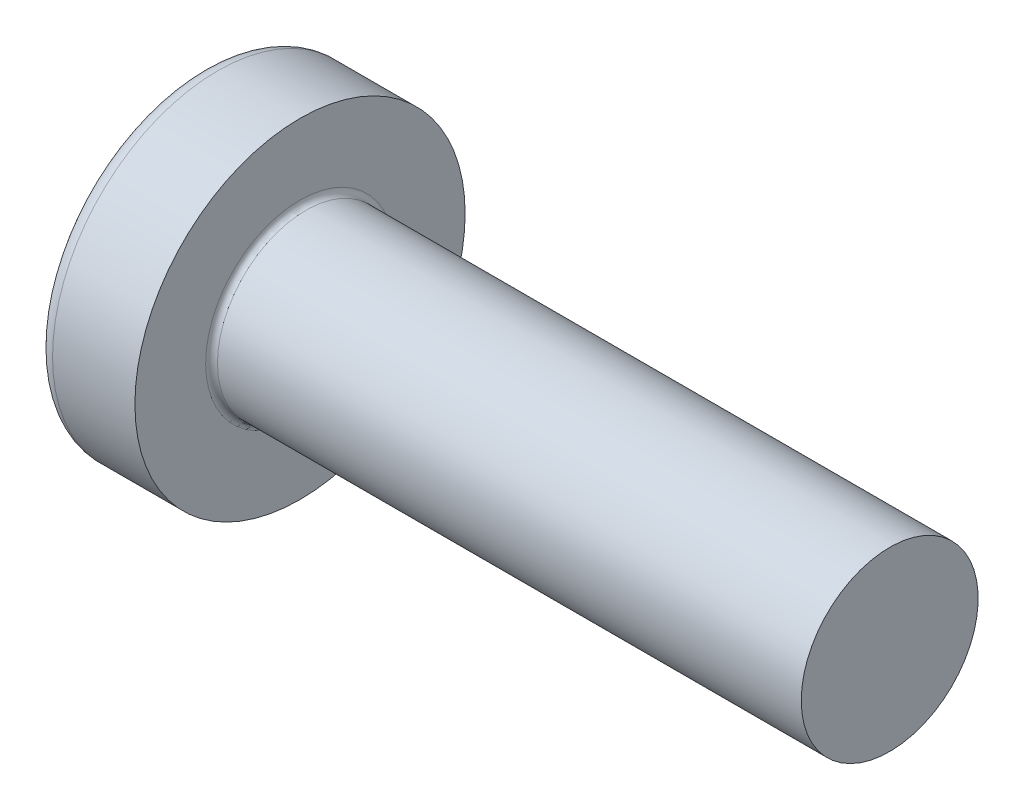
ISO-10303-21;
HEADER;
FILE_DESCRIPTION(('STEP AP214'),'2;1');
FILE_NAME('part.step','',(''),(''),'','','');
FILE_SCHEMA(('AUTOMOTIVE_DESIGN { 1 0 10303 214 1 1 1 1 }'));
ENDSEC;
DATA;
#1=APPLICATION_CONTEXT('core data for automotive mechanical design processes');
#2=APPLICATION_PROTOCOL_DEFINITION('international standard','automotive_design',2000,#1);
#3=PRODUCT_CONTEXT('',#1,'mechanical');
#4=PRODUCT('Part','Part','',(#3));
#5=PRODUCT_RELATED_PRODUCT_CATEGORY('part','',(#4));
#6=PRODUCT_DEFINITION_FORMATION('','',#4);
#7=PRODUCT_DEFINITION_CONTEXT('part definition',#1,'design');
#8=PRODUCT_DEFINITION('design','',#6,#7);
#9=PRODUCT_DEFINITION_SHAPE('','',#8);
#10=(LENGTH_UNIT() NAMED_UNIT(*) SI_UNIT(.MILLI.,.METRE.));
#11=(NAMED_UNIT(*) PLANE_ANGLE_UNIT() SI_UNIT($,.RADIAN.));
#12=(NAMED_UNIT(*) SI_UNIT($,.STERADIAN.) SOLID_ANGLE_UNIT());
#13=UNCERTAINTY_MEASURE_WITH_UNIT(LENGTH_MEASURE(1.E-05),#10,'distance_accuracy_value','');
#14=(GEOMETRIC_REPRESENTATION_CONTEXT(3) GLOBAL_UNCERTAINTY_ASSIGNED_CONTEXT((#13)) GLOBAL_UNIT_ASSIGNED_CONTEXT((#10,
#11,#12)) REPRESENTATION_CONTEXT('',''));
#15=CARTESIAN_POINT('',(0.,0.,0.));
#16=DIRECTION('',(0.,0.,1.));
#17=DIRECTION('',(1.,0.,0.));
#18=AXIS2_PLACEMENT_3D('',#15,#16,#17);
#19=CARTESIAN_POINT('',(5.,0.,0.));
#20=DIRECTION('',(-1.,0.,0.));
#21=DIRECTION('',(0.,1.,0.));
#22=AXIS2_PLACEMENT_3D('',#19,#20,#21);
#23=SPHERICAL_SURFACE('',#22,5.);
#24=CARTESIAN_POINT('',(0.775371598933733,0.,0.));
#25=DIRECTION('',(-1.,0.,0.));
#26=DIRECTION('',(0.,0.,1.));
#27=AXIS2_PLACEMENT_3D('',#24,#25,#26);
#28=CIRCLE('',#27,2.67441860465116);
#29=CARTESIAN_POINT('',(0.775371598933733,0.,2.67441860465116));
#30=VERTEX_POINT('',#29);
#31=EDGE_CURVE('E239',#30,#30,#28,.T.);
#32=ORIENTED_EDGE('',*,*,#31,.T.);
#33=EDGE_LOOP('',(#32));
#34=FACE_BOUND('',#33,.T.);
#35=CARTESIAN_POINT('',(0.0457951200896417,0.,0.));
#36=DIRECTION('',(1.,0.,0.));
#37=DIRECTION('',(0.,0.,-1.));
#38=AXIS2_PLACEMENT_3D('',#35,#36,#37);
#39=CIRCLE('',#38,0.675169614150692);
#40=CARTESIAN_POINT('',(0.0457951200896426,-0.369999999999998,-0.564760133040919));
#41=VERTEX_POINT('',#40);
#42=CARTESIAN_POINT('',(0.0457951200896417,-0.564760133040917,-0.37));
#43=VERTEX_POINT('',#42);
#44=EDGE_CURVE('E375',#41,#43,#39,.F.);
#45=ORIENTED_EDGE('',*,*,#44,.F.);
#46=CARTESIAN_POINT('',(5.,-0.37,0.));
#47=DIRECTION('',(0.,1.,0.));
#48=DIRECTION('',(0.,0.,1.));
#49=AXIS2_PLACEMENT_3D('',#46,#47,#48);
#50=CIRCLE('',#49,4.98629120689917);
#51=CARTESIAN_POINT('',(0.187869731256034,-0.369999999999995,-1.30633161051784));
#52=VERTEX_POINT('',#51);
#53=EDGE_CURVE('E301',#52,#41,#50,.T.);
#54=ORIENTED_EDGE('',*,*,#53,.F.);
#55=CARTESIAN_POINT('',(4.56358245832426,0.,0.875318202045668));
#56=DIRECTION('',(0.446197800778958,0.,-0.894934367749961));
#57=DIRECTION('',(-0.89493436774996,0.,-0.446197800778958));
#58=AXIS2_PLACEMENT_3D('',#55,#56,#57);
#59=CIRCLE('',#58,4.90340267309195);
#60=CARTESIAN_POINT('',(0.187869731256035,0.370000000000005,-1.30633161051784));
#61=VERTEX_POINT('',#60);
#62=EDGE_CURVE('E273',#52,#61,#59,.T.);
#63=ORIENTED_EDGE('',*,*,#62,.T.);
#64=CARTESIAN_POINT('',(5.,0.37,0.));
#65=DIRECTION('',(0.,-1.,0.));
#66=DIRECTION('',(0.,0.,-1.));
#67=AXIS2_PLACEMENT_3D('',#64,#65,#66);
#68=CIRCLE('',#67,4.98629120689917);
#69=CARTESIAN_POINT('',(0.0457951200896421,0.370000000000002,-0.564760133040916));
#70=VERTEX_POINT('',#69);
#71=EDGE_CURVE('E328',#70,#61,#68,.T.);
#72=ORIENTED_EDGE('',*,*,#71,.F.);
#73=CARTESIAN_POINT('',(0.0457951200896417,0.564760133040915,-0.37));
#74=VERTEX_POINT('',#73);
#75=EDGE_CURVE('E394',#74,#70,#39,.F.);
#76=ORIENTED_EDGE('',*,*,#75,.F.);
#77=CARTESIAN_POINT('',(5.,0.,-0.37));
#78=DIRECTION('',(0.,0.,1.));
#79=DIRECTION('',(1.,0.,0.));
#80=AXIS2_PLACEMENT_3D('',#77,#78,#79);
#81=CIRCLE('',#80,4.98629120689917);
#82=CARTESIAN_POINT('',(0.187869731256035,1.30633161051784,-0.37));
#83=VERTEX_POINT('',#82);
#84=EDGE_CURVE('E267',#83,#74,#81,.T.);
#85=ORIENTED_EDGE('',*,*,#84,.F.);
#86=CARTESIAN_POINT('',(4.56358245832426,-0.875318202045668,0.));
#87=DIRECTION('',(0.446197800778958,0.89493436774996,0.));
#88=DIRECTION('',(-0.89493436774996,0.446197800778958,0.));
#89=AXIS2_PLACEMENT_3D('',#86,#87,#88);
#90=CIRCLE('',#89,4.90340267309195);
#91=CARTESIAN_POINT('',(0.187869731256034,1.30633161051784,0.37));
#92=VERTEX_POINT('',#91);
#93=EDGE_CURVE('E270',#83,#92,#90,.T.);
#94=ORIENTED_EDGE('',*,*,#93,.T.);
#95=CARTESIAN_POINT('',(5.,0.,0.37));
#96=DIRECTION('',(0.,0.,-1.));
#97=DIRECTION('',(0.,1.,0.));
#98=AXIS2_PLACEMENT_3D('',#95,#96,#97);
#99=CIRCLE('',#98,4.98629120689917);
#100=CARTESIAN_POINT('',(0.0457951200896417,0.564760133040915,0.37));
#101=VERTEX_POINT('',#100);
#102=EDGE_CURVE('E263',#101,#92,#99,.T.);
#103=ORIENTED_EDGE('',*,*,#102,.F.);
#104=CARTESIAN_POINT('',(0.0457951200896426,0.369999999999998,0.564760133040918));
#105=VERTEX_POINT('',#104);
#106=EDGE_CURVE('E393',#105,#101,#39,.F.);
#107=ORIENTED_EDGE('',*,*,#106,.F.);
#108=CARTESIAN_POINT('',(0.187869731256034,0.369999999999995,1.30633161051784));
#109=VERTEX_POINT('',#108);
#110=EDGE_CURVE('E283',#109,#105,#68,.T.);
#111=ORIENTED_EDGE('',*,*,#110,.F.);
#112=CARTESIAN_POINT('',(4.56358245832426,0.,-0.875318202045668));
#113=DIRECTION('',(0.446197800778958,0.,0.89493436774996));
#114=DIRECTION('',(0.89493436774996,0.,-0.446197800778958));
#115=AXIS2_PLACEMENT_3D('',#112,#113,#114);
#116=CIRCLE('',#115,4.90340267309195);
#117=CARTESIAN_POINT('',(0.187869731256034,-0.370000000000004,1.30633161051784));
#118=VERTEX_POINT('',#117);
#119=EDGE_CURVE('E50',#109,#118,#116,.T.);
#120=ORIENTED_EDGE('',*,*,#119,.T.);
#121=CARTESIAN_POINT('',(0.0457951200896417,-0.370000000000002,0.564760133040916));
#122=VERTEX_POINT('',#121);
#123=EDGE_CURVE('E280',#122,#118,#50,.T.);
#124=ORIENTED_EDGE('',*,*,#123,.F.);
#125=CARTESIAN_POINT('',(0.0457951200896417,-0.564760133040917,0.37));
#126=VERTEX_POINT('',#125);
#127=EDGE_CURVE('E429',#126,#122,#39,.F.);
#128=ORIENTED_EDGE('',*,*,#127,.F.);
#129=CARTESIAN_POINT('',(0.187869731256033,-1.30633161051784,0.369999999999999));
#130=VERTEX_POINT('',#129);
#131=EDGE_CURVE('E264',#130,#126,#99,.T.);
#132=ORIENTED_EDGE('',*,*,#131,.F.);
#133=CARTESIAN_POINT('',(4.56358245832426,0.875318202045668,0.));
#134=DIRECTION('',(0.446197800778958,-0.894934367749961,0.));
#135=DIRECTION('',(0.89493436774996,0.446197800778958,0.));
#136=AXIS2_PLACEMENT_3D('',#133,#134,#135);
#137=CIRCLE('',#136,4.90340267309195);
#138=CARTESIAN_POINT('',(0.187869731256033,-1.30633161051784,-0.37));
#139=VERTEX_POINT('',#138);
#140=EDGE_CURVE('E260',#130,#139,#137,.T.);
#141=ORIENTED_EDGE('',*,*,#140,.T.);
#142=EDGE_CURVE('E65',#43,#139,#81,.T.);
#143=ORIENTED_EDGE('',*,*,#142,.F.);
#144=EDGE_LOOP('',(#45,#54,#63,#72,#76,#85,#94,#103,#107,#111,#120,#124,#128,#132,#141,#143));
#145=FACE_BOUND('',#144,.T.);
#146=ADVANCED_FACE('F37',(#34,#145),#23,.T.);
#147=CARTESIAN_POINT('',(1.75,0.527482216012805,-0.37));
#148=DIRECTION('',(0.,0.,1.));
#149=DIRECTION('',(1.,0.,0.));
#150=AXIS2_PLACEMENT_3D('',#147,#148,#149);
#151=PLANE('',#150);
#152=ORIENTED_EDGE('',*,*,#84,.T.);
#153=CARTESIAN_POINT('',(-0.987293237053716,0.649401255967161,-0.37));
#154=CARTESIAN_POINT('',(-0.781914975317084,0.632865887002871,-0.37));
#155=CARTESIAN_POINT('',(-0.576547882393372,0.616188977635081,-0.37));
#156=CARTESIAN_POINT('',(-0.165841599226327,0.582441031964227,-0.37));
#157=CARTESIAN_POINT('',(0.0394975903090453,0.56536998705488,-0.37));
#158=CARTESIAN_POINT('',(0.450133475422572,0.530723441326535,-0.37));
#159=CARTESIAN_POINT('',(0.655430171010574,0.513147940624557,-0.37));
#160=CARTESIAN_POINT('',(1.06596140177934,0.477314957985794,-0.37));
#161=CARTESIAN_POINT('',(1.2711959378071,0.459057485806066,-0.37));
#162=CARTESIAN_POINT('',(1.61065292365626,0.428051938688768,-0.37));
#163=CARTESIAN_POINT('',(1.74490059995642,0.415580824990931,-0.37));
#164=CARTESIAN_POINT('',(2.01334321762763,0.39009202340498,-0.37));
#165=CARTESIAN_POINT('',(2.14753815934577,0.377074339177353,-0.37));
#166=CARTESIAN_POINT('',(2.41586354151957,0.350315629452842,-0.37));
#167=CARTESIAN_POINT('',(2.5499939784531,0.33657456817765,-0.37));
#168=CARTESIAN_POINT('',(2.81814173295471,0.308004077741875,-0.37));
#169=CARTESIAN_POINT('',(2.95215904765134,0.293174621747065,-0.37));
#170=CARTESIAN_POINT('',(3.0860955068368,0.277618485071816,-0.37));
#171=B_SPLINE_CURVE_WITH_KNOTS('',3,(#153,#154,#155,#156,#157,#158,#159,#160,#161,#162,#163,
#164,#165,#166,#167,#168,#169,#170),.UNSPECIFIED.,.F.,.F.,(4,2,2,2,2,2,2,2,4),(0.,
0.618128793984691,1.23627109812525,1.85441325887562,2.4725465791681,2.87702276218609,
3.28149623678161,3.68598973550942,4.09049321032311),.UNSPECIFIED.);
#172=CARTESIAN_POINT('',(1.75,0.415013252800437,-0.37));
#173=VERTEX_POINT('',#172);
#174=EDGE_CURVE('E415',#74,#173,#171,.T.);
#175=ORIENTED_EDGE('',*,*,#174,.T.);
#176=DIRECTION('',(0.,1.,0.));
#177=VECTOR('',#176,1.);
#178=CARTESIAN_POINT('',(1.75,-0.527482216012805,-0.37));
#179=LINE('',#178,#177);
#180=CARTESIAN_POINT('',(1.75,0.527482216012805,-0.37));
#181=VERTEX_POINT('',#180);
#182=EDGE_CURVE('E357',#173,#181,#179,.T.);
#183=ORIENTED_EDGE('',*,*,#182,.T.);
#184=DIRECTION('',(0.89493436774996,-0.446197800778958,0.));
#185=VECTOR('',#184,1.);
#186=CARTESIAN_POINT('',(0.,1.4,-0.37));
#187=LINE('',#186,#185);
#188=EDGE_CURVE('E240',#83,#181,#187,.T.);
#189=ORIENTED_EDGE('',*,*,#188,.F.);
#190=EDGE_LOOP('',(#152,#175,#183,#189));
#191=FACE_BOUND('',#190,.T.);
#192=ADVANCED_FACE('F195',(#191),#151,.T.);
#193=CARTESIAN_POINT('',(1.75,-0.527482216012805,-0.37));
#194=VERTEX_POINT('',#193);
#195=CARTESIAN_POINT('',(1.75,-0.415013252800437,-0.37));
#196=VERTEX_POINT('',#195);
#197=EDGE_CURVE('E248',#194,#196,#179,.T.);
#198=ORIENTED_EDGE('',*,*,#197,.T.);
#199=CARTESIAN_POINT('',(-0.987293237053716,-0.649401255967161,-0.37));
#200=CARTESIAN_POINT('',(-0.781914975317084,-0.632865887002871,-0.37));
#201=CARTESIAN_POINT('',(-0.576547882393373,-0.616188977635081,-0.37));
#202=CARTESIAN_POINT('',(-0.165841599226327,-0.582441031964227,-0.37));
#203=CARTESIAN_POINT('',(0.0394975903090452,-0.565369987054879,-0.37));
#204=CARTESIAN_POINT('',(0.450133475422572,-0.530723441326535,-0.37));
#205=CARTESIAN_POINT('',(0.655430171010574,-0.513147940624557,-0.37));
#206=CARTESIAN_POINT('',(1.06596140177934,-0.477314957985794,-0.37));
#207=CARTESIAN_POINT('',(1.2711959378071,-0.459057485806066,-0.37));
#208=CARTESIAN_POINT('',(1.61065292365626,-0.428051938688768,-0.37));
#209=CARTESIAN_POINT('',(1.74490059995643,-0.415580824990931,-0.37));
#210=CARTESIAN_POINT('',(2.01334321762763,-0.390092023404979,-0.37));
#211=CARTESIAN_POINT('',(2.14753815934577,-0.377074339177353,-0.37));
#212=CARTESIAN_POINT('',(2.41586354151957,-0.350315629452842,-0.37));
#213=CARTESIAN_POINT('',(2.5499939784531,-0.33657456817765,-0.37));
#214=CARTESIAN_POINT('',(2.81814173295471,-0.308004077741875,-0.37));
#215=CARTESIAN_POINT('',(2.95215904765134,-0.293174621747065,-0.37));
#216=CARTESIAN_POINT('',(3.0860955068368,-0.277618485071816,-0.37));
#217=B_SPLINE_CURVE_WITH_KNOTS('',3,(#199,#200,#201,#202,#203,#204,#205,#206,#207,#208,#209,
#210,#211,#212,#213,#214,#215,#216),.UNSPECIFIED.,.F.,.F.,(4,2,2,2,2,2,2,2,4),(0.,
0.618128793984691,1.23627109812525,1.85441325887562,2.4725465791681,2.87702276218609,
3.28149623678161,3.68598973550942,4.09049321032311),.UNSPECIFIED.);
#218=EDGE_CURVE('E392',#196,#43,#217,.F.);
#219=ORIENTED_EDGE('',*,*,#218,.T.);
#220=ORIENTED_EDGE('',*,*,#142,.T.);
#221=DIRECTION('',(0.89493436774996,0.446197800778958,0.));
#222=VECTOR('',#221,1.);
#223=CARTESIAN_POINT('',(0.,-1.4,-0.37));
#224=LINE('',#223,#222);
#225=EDGE_CURVE('E331',#139,#194,#224,.T.);
#226=ORIENTED_EDGE('',*,*,#225,.T.);
#227=EDGE_LOOP('',(#198,#219,#220,#226));
#228=FACE_BOUND('',#227,.T.);
#229=ADVANCED_FACE('F201',(#228),#151,.T.);
#230=CARTESIAN_POINT('',(1.75,-0.527482216012805,0.37));
#231=DIRECTION('',(0.,0.,-1.));
#232=DIRECTION('',(0.,1.,0.));
#233=AXIS2_PLACEMENT_3D('',#230,#231,#232);
#234=PLANE('',#233);
#235=DIRECTION('',(0.,-1.,0.));
#236=VECTOR('',#235,1.);
#237=CARTESIAN_POINT('',(1.75,0.527482216012805,0.37));
#238=LINE('',#237,#236);
#239=CARTESIAN_POINT('',(1.75,0.527482216012805,0.37));
#240=VERTEX_POINT('',#239);
#241=CARTESIAN_POINT('',(1.75,0.415013252800437,0.37));
#242=VERTEX_POINT('',#241);
#243=EDGE_CURVE('E340',#240,#242,#238,.T.);
#244=ORIENTED_EDGE('',*,*,#243,.T.);
#245=CARTESIAN_POINT('',(-0.987293237053716,0.649401255967161,0.37));
#246=CARTESIAN_POINT('',(-0.781914975317085,0.632865887002871,0.37));
#247=CARTESIAN_POINT('',(-0.576547882393373,0.616188977635081,0.37));
#248=CARTESIAN_POINT('',(-0.165841599226327,0.582441031964227,0.37));
#249=CARTESIAN_POINT('',(0.0394975903090452,0.56536998705488,0.37));
#250=CARTESIAN_POINT('',(0.450133475422572,0.530723441326535,0.37));
#251=CARTESIAN_POINT('',(0.655430171010574,0.513147940624557,0.37));
#252=CARTESIAN_POINT('',(1.06596140177934,0.477314957985794,0.37));
#253=CARTESIAN_POINT('',(1.2711959378071,0.459057485806066,0.37));
#254=CARTESIAN_POINT('',(1.61065292365626,0.428051938688769,0.37));
#255=CARTESIAN_POINT('',(1.74490059995643,0.415580824990931,0.37));
#256=CARTESIAN_POINT('',(2.01334321762763,0.39009202340498,0.37));
#257=CARTESIAN_POINT('',(2.14753815934577,0.377074339177353,0.37));
#258=CARTESIAN_POINT('',(2.41586354151957,0.350315629452843,0.37));
#259=CARTESIAN_POINT('',(2.5499939784531,0.33657456817765,0.37));
#260=CARTESIAN_POINT('',(2.81814173295471,0.308004077741875,0.37));
#261=CARTESIAN_POINT('',(2.95215904765134,0.293174621747065,0.37));
#262=CARTESIAN_POINT('',(3.0860955068368,0.277618485071816,0.37));
#263=B_SPLINE_CURVE_WITH_KNOTS('',3,(#245,#246,#247,#248,#249,#250,#251,#252,#253,#254,#255,
#256,#257,#258,#259,#260,#261,#262),.UNSPECIFIED.,.F.,.F.,(4,2,2,2,2,2,2,2,4),(0.,
0.618128793984691,1.23627109812525,1.85441325887562,2.4725465791681,2.87702276218609,
3.28149623678161,3.68598973550942,4.09049321032311),.UNSPECIFIED.);
#264=EDGE_CURVE('E667',#242,#101,#263,.F.);
#265=ORIENTED_EDGE('',*,*,#264,.T.);
#266=ORIENTED_EDGE('',*,*,#102,.T.);
#267=DIRECTION('',(0.89493436774996,-0.446197800778958,0.));
#268=VECTOR('',#267,1.);
#269=CARTESIAN_POINT('',(0.,1.4,0.37));
#270=LINE('',#269,#268);
#271=EDGE_CURVE('E245',#92,#240,#270,.T.);
#272=ORIENTED_EDGE('',*,*,#271,.T.);
#273=EDGE_LOOP('',(#244,#265,#266,#272));
#274=FACE_BOUND('',#273,.T.);
#275=ADVANCED_FACE('F411',(#274),#234,.T.);
#276=ORIENTED_EDGE('',*,*,#131,.T.);
#277=CARTESIAN_POINT('',(-0.987293237069635,-0.649401255968442,0.369999999999999));
#278=CARTESIAN_POINT('',(-0.781914975331301,-0.632865887004024,0.369999999999999));
#279=CARTESIAN_POINT('',(-0.576547882405888,-0.616188977636103,0.37));
#280=CARTESIAN_POINT('',(-0.16584159923544,-0.582441031964983,0.37));
#281=CARTESIAN_POINT('',(0.039497590301634,-0.5653699870555,0.37));
#282=CARTESIAN_POINT('',(0.450133475420602,-0.530723441326706,0.37));
#283=CARTESIAN_POINT('',(0.655430171012341,-0.513147940624409,0.37));
#284=CARTESIAN_POINT('',(1.06596140178858,-0.477314957984981,0.37));
#285=CARTESIAN_POINT('',(1.27119593782008,-0.459057485804908,0.37));
#286=CARTESIAN_POINT('',(1.61065292367297,-0.428051938687225,0.37));
#287=CARTESIAN_POINT('',(1.74490059997313,-0.415580824989367,0.37));
#288=CARTESIAN_POINT('',(2.01334321764434,-0.390092023403371,0.37));
#289=CARTESIAN_POINT('',(2.14753815936247,-0.377074339175718,0.37));
#290=CARTESIAN_POINT('',(2.41586354153627,-0.350315629451146,0.37));
#291=CARTESIAN_POINT('',(2.54999397846979,-0.336574568175918,0.37));
#292=CARTESIAN_POINT('',(2.8181417329714,-0.308004077740054,0.37));
#293=CARTESIAN_POINT('',(2.95215904766802,-0.293174621745189,0.37));
#294=CARTESIAN_POINT('',(3.08609550685347,-0.277618485069873,0.37));
#295=B_SPLINE_CURVE_WITH_KNOTS('',3,(#277,#278,#279,#280,#281,#282,#283,#284,#285,#286,#287,
#288,#289,#290,#291,#292,#293,#294),.UNSPECIFIED.,.F.,.F.,(4,2,2,2,2,2,2,2,4),(0.,
0.61812879398981,1.23627109813549,1.85441325889711,2.47254657920086,2.87702276221884,
3.28149623681436,3.68598973554217,4.09049321035586),.UNSPECIFIED.);
#296=CARTESIAN_POINT('',(1.75,-0.415013252800437,0.37));
#297=VERTEX_POINT('',#296);
#298=EDGE_CURVE('E430',#126,#297,#295,.T.);
#299=ORIENTED_EDGE('',*,*,#298,.T.);
#300=CARTESIAN_POINT('',(1.75,-0.527482216012806,0.37));
#301=VERTEX_POINT('',#300);
#302=EDGE_CURVE('E342',#297,#301,#238,.T.);
#303=ORIENTED_EDGE('',*,*,#302,.T.);
#304=DIRECTION('',(0.89493436774996,0.446197800778958,0.));
#305=VECTOR('',#304,1.);
#306=CARTESIAN_POINT('',(0.,-1.4,0.369999999999999));
#307=LINE('',#306,#305);
#308=EDGE_CURVE('E333',#130,#301,#307,.T.);
#309=ORIENTED_EDGE('',*,*,#308,.F.);
#310=EDGE_LOOP('',(#276,#299,#303,#309));
#311=FACE_BOUND('',#310,.T.);
#312=ADVANCED_FACE('F521',(#311),#234,.T.);
#313=CARTESIAN_POINT('',(0.,1.4,0.37));
#314=DIRECTION('',(0.446197800778958,0.89493436774996,0.));
#315=DIRECTION('',(-0.89493436774996,0.446197800778958,0.));
#316=AXIS2_PLACEMENT_3D('',#313,#314,#315);
#317=PLANE('',#316);
#318=CARTESIAN_POINT('',(2.66965234556629,0.0689604865315906,0.));
#319=DIRECTION('',(0.446197800778958,0.89493436774996,0.));
#320=DIRECTION('',(-0.89493436774996,0.446197800778958,0.));
#321=AXIS2_PLACEMENT_3D('',#318,#319,#320);
#322=ELLIPSE('',#321,1.10195891266117,0.486831719863513);
#323=CARTESIAN_POINT('',(1.75,0.527482216012806,0.175779725196677));
#324=VERTEX_POINT('',#323);
#325=CARTESIAN_POINT('',(1.75,0.527482216012806,-0.175779725196677));
#326=VERTEX_POINT('',#325);
#327=EDGE_CURVE('E306',#324,#326,#322,.F.);
#328=ORIENTED_EDGE('',*,*,#327,.F.);
#329=DIRECTION('',(0.,0.,-1.));
#330=VECTOR('',#329,1.);
#331=CARTESIAN_POINT('',(1.75,0.527482216012805,0.37));
#332=LINE('',#331,#330);
#333=EDGE_CURVE('E343',#240,#324,#332,.T.);
#334=ORIENTED_EDGE('',*,*,#333,.F.);
#335=ORIENTED_EDGE('',*,*,#271,.F.);
#336=ORIENTED_EDGE('',*,*,#93,.F.);
#337=ORIENTED_EDGE('',*,*,#188,.T.);
#338=EDGE_CURVE('E345',#326,#181,#332,.T.);
#339=ORIENTED_EDGE('',*,*,#338,.F.);
#340=EDGE_LOOP('',(#328,#334,#335,#336,#337,#339));
#341=FACE_BOUND('',#340,.T.);
#342=ADVANCED_FACE('F409',(#341),#317,.F.);
#343=CARTESIAN_POINT('',(0.,-1.4,-0.37));
#344=DIRECTION('',(0.446197800778958,-0.894934367749961,0.));
#345=DIRECTION('',(0.89493436774996,0.446197800778958,0.));
#346=AXIS2_PLACEMENT_3D('',#343,#344,#345);
#347=PLANE('',#346);
#348=CARTESIAN_POINT('',(2.66965234556629,-0.0689604865315898,0.));
#349=DIRECTION('',(0.446197800778958,-0.894934367749961,0.));
#350=DIRECTION('',(-0.89493436774996,-0.446197800778958,0.));
#351=AXIS2_PLACEMENT_3D('',#348,#349,#350);
#352=ELLIPSE('',#351,1.10195891266117,0.486831719863514);
#353=CARTESIAN_POINT('',(1.75,-0.527482216012806,-0.175779725196677));
#354=VERTEX_POINT('',#353);
#355=CARTESIAN_POINT('',(1.75,-0.527482216012806,0.175779725196677));
#356=VERTEX_POINT('',#355);
#357=EDGE_CURVE('E669',#354,#356,#352,.F.);
#358=ORIENTED_EDGE('',*,*,#357,.F.);
#359=DIRECTION('',(0.,0.,1.));
#360=VECTOR('',#359,1.);
#361=CARTESIAN_POINT('',(1.75,-0.527482216012805,-0.37));
#362=LINE('',#361,#360);
#363=EDGE_CURVE('E336',#194,#354,#362,.T.);
#364=ORIENTED_EDGE('',*,*,#363,.F.);
#365=ORIENTED_EDGE('',*,*,#225,.F.);
#366=ORIENTED_EDGE('',*,*,#140,.F.);
#367=ORIENTED_EDGE('',*,*,#308,.T.);
#368=EDGE_CURVE('E339',#356,#301,#362,.T.);
#369=ORIENTED_EDGE('',*,*,#368,.F.);
#370=EDGE_LOOP('',(#358,#364,#365,#366,#367,#369));
#371=FACE_BOUND('',#370,.T.);
#372=ADVANCED_FACE('F508',(#371),#347,.F.);
#373=CARTESIAN_POINT('',(1.75,0.527482216012805,-0.37));
#374=DIRECTION('',(-1.,0.,0.));
#375=DIRECTION('',(0.,0.,1.));
#376=AXIS2_PLACEMENT_3D('',#373,#374,#375);
#377=PLANE('',#376);
#378=DIRECTION('',(0.,1.,0.));
#379=VECTOR('',#378,1.);
#380=CARTESIAN_POINT('',(1.75,-0.370000000000002,0.527482216012804));
#381=LINE('',#380,#379);
#382=CARTESIAN_POINT('',(1.75,-0.370000000000002,0.527482216012804));
#383=VERTEX_POINT('',#382);
#384=CARTESIAN_POINT('',(1.75,-0.175779725196681,0.527482216012805));
#385=VERTEX_POINT('',#384);
#386=EDGE_CURVE('E321',#383,#385,#381,.T.);
#387=ORIENTED_EDGE('',*,*,#386,.T.);
#388=CARTESIAN_POINT('',(1.75,0.,0.));
#389=DIRECTION('',(-1.,0.,0.));
#390=DIRECTION('',(0.,0.,1.));
#391=AXIS2_PLACEMENT_3D('',#388,#389,#390);
#392=CIRCLE('',#391,0.556);
#393=CARTESIAN_POINT('',(1.75,-0.370000000000001,0.415013252800437));
#394=VERTEX_POINT('',#393);
#395=EDGE_CURVE('E695',#394,#385,#392,.T.);
#396=ORIENTED_EDGE('',*,*,#395,.F.);
#397=DIRECTION('',(0.,0.,-1.));
#398=VECTOR('',#397,1.);
#399=CARTESIAN_POINT('',(1.75,-0.370000000000002,0.527482216012804));
#400=LINE('',#399,#398);
#401=EDGE_CURVE('E317',#383,#394,#400,.T.);
#402=ORIENTED_EDGE('',*,*,#401,.F.);
#403=EDGE_LOOP('',(#387,#396,#402));
#404=FACE_BOUND('',#403,.T.);
#405=ADVANCED_FACE('F465',(#404),#377,.T.);
#406=ORIENTED_EDGE('',*,*,#302,.F.);
#407=EDGE_CURVE('E700',#356,#297,#392,.T.);
#408=ORIENTED_EDGE('',*,*,#407,.F.);
#409=ORIENTED_EDGE('',*,*,#368,.T.);
#410=EDGE_LOOP('',(#406,#408,#409));
#411=FACE_BOUND('',#410,.T.);
#412=ADVANCED_FACE('F495',(#411),#377,.T.);
#413=ORIENTED_EDGE('',*,*,#363,.T.);
#414=EDGE_CURVE('E386',#196,#354,#392,.T.);
#415=ORIENTED_EDGE('',*,*,#414,.F.);
#416=ORIENTED_EDGE('',*,*,#197,.F.);
#417=EDGE_LOOP('',(#413,#415,#416));
#418=FACE_BOUND('',#417,.T.);
#419=ADVANCED_FACE('F489',(#418),#377,.T.);
#420=CARTESIAN_POINT('',(1.75,-0.369999999999998,-0.415013252800438));
#421=VERTEX_POINT('',#420);
#422=CARTESIAN_POINT('',(1.75,-0.369999999999998,-0.527482216012807));
#423=VERTEX_POINT('',#422);
#424=EDGE_CURVE('E320',#421,#423,#400,.T.);
#425=ORIENTED_EDGE('',*,*,#424,.F.);
#426=CARTESIAN_POINT('',(1.75,-0.175779725196678,-0.527482216012806));
#427=VERTEX_POINT('',#426);
#428=EDGE_CURVE('E57',#427,#421,#392,.T.);
#429=ORIENTED_EDGE('',*,*,#428,.F.);
#430=DIRECTION('',(0.,-1.,0.));
#431=VECTOR('',#430,1.);
#432=CARTESIAN_POINT('',(1.75,0.370000000000002,-0.527482216012804));
#433=LINE('',#432,#431);
#434=EDGE_CURVE('E316',#427,#423,#433,.T.);
#435=ORIENTED_EDGE('',*,*,#434,.T.);
#436=EDGE_LOOP('',(#425,#429,#435));
#437=FACE_BOUND('',#436,.T.);
#438=ADVANCED_FACE('F381',(#437),#377,.T.);
#439=CARTESIAN_POINT('',(1.75,0.370000000000002,-0.527482216012804));
#440=VERTEX_POINT('',#439);
#441=CARTESIAN_POINT('',(1.75,0.175779725196681,-0.527482216012805));
#442=VERTEX_POINT('',#441);
#443=EDGE_CURVE('E313',#440,#442,#433,.T.);
#444=ORIENTED_EDGE('',*,*,#443,.T.);
#445=CARTESIAN_POINT('',(1.75,0.370000000000001,-0.415013252800436));
#446=VERTEX_POINT('',#445);
#447=EDGE_CURVE('E385',#446,#442,#392,.T.);
#448=ORIENTED_EDGE('',*,*,#447,.F.);
#449=DIRECTION('',(0.,0.,1.));
#450=VECTOR('',#449,1.);
#451=CARTESIAN_POINT('',(1.75,0.370000000000002,-0.527482216012804));
#452=LINE('',#451,#450);
#453=EDGE_CURVE('E325',#440,#446,#452,.T.);
#454=ORIENTED_EDGE('',*,*,#453,.F.);
#455=EDGE_LOOP('',(#444,#448,#454));
#456=FACE_BOUND('',#455,.T.);
#457=ADVANCED_FACE('F477',(#456),#377,.T.);
#458=ORIENTED_EDGE('',*,*,#182,.F.);
#459=EDGE_CURVE('E684',#326,#173,#392,.T.);
#460=ORIENTED_EDGE('',*,*,#459,.F.);
#461=ORIENTED_EDGE('',*,*,#338,.T.);
#462=EDGE_LOOP('',(#458,#460,#461));
#463=FACE_BOUND('',#462,.T.);
#464=ADVANCED_FACE('F471',(#463),#377,.T.);
#465=ORIENTED_EDGE('',*,*,#333,.T.);
#466=EDGE_CURVE('E686',#242,#324,#392,.T.);
#467=ORIENTED_EDGE('',*,*,#466,.F.);
#468=ORIENTED_EDGE('',*,*,#243,.F.);
#469=EDGE_LOOP('',(#465,#467,#468));
#470=FACE_BOUND('',#469,.T.);
#471=ADVANCED_FACE('F463',(#470),#377,.T.);
#472=CARTESIAN_POINT('',(1.75,0.369999999999999,0.415013252800439));
#473=VERTEX_POINT('',#472);
#474=CARTESIAN_POINT('',(1.75,0.369999999999998,0.527482216012807));
#475=VERTEX_POINT('',#474);
#476=EDGE_CURVE('E298',#473,#475,#452,.T.);
#477=ORIENTED_EDGE('',*,*,#476,.F.);
#478=CARTESIAN_POINT('',(1.75,0.175779725196678,0.527482216012806));
#479=VERTEX_POINT('',#478);
#480=EDGE_CURVE('E387',#479,#473,#392,.T.);
#481=ORIENTED_EDGE('',*,*,#480,.F.);
#482=EDGE_CURVE('E324',#479,#475,#381,.T.);
#483=ORIENTED_EDGE('',*,*,#482,.T.);
#484=EDGE_LOOP('',(#477,#481,#483));
#485=FACE_BOUND('',#484,.T.);
#486=ADVANCED_FACE('F457',(#485),#377,.T.);
#487=CARTESIAN_POINT('',(1.75,0.369999999999998,0.527482216012807));
#488=DIRECTION('',(0.,-1.,0.));
#489=DIRECTION('',(1.,0.,0.));
#490=AXIS2_PLACEMENT_3D('',#487,#488,#489);
#491=PLANE('',#490);
#492=ORIENTED_EDGE('',*,*,#110,.T.);
#493=CARTESIAN_POINT('',(-0.987293237069635,0.369999999999998,0.649401255968443));
#494=CARTESIAN_POINT('',(-0.781914975331301,0.369999999999998,0.632865887004025));
#495=CARTESIAN_POINT('',(-0.576547882405888,0.369999999999998,0.616188977636104));
#496=CARTESIAN_POINT('',(-0.16584159923544,0.369999999999998,0.582441031964984));
#497=CARTESIAN_POINT('',(0.0394975903016339,0.369999999999998,0.565369987055501));
#498=CARTESIAN_POINT('',(0.450133475420602,0.369999999999998,0.530723441326707));
#499=CARTESIAN_POINT('',(0.655430171012341,0.369999999999998,0.51314794062441));
#500=CARTESIAN_POINT('',(1.06596140178858,0.369999999999998,0.477314957984982));
#501=CARTESIAN_POINT('',(1.27119593782008,0.369999999999998,0.459057485804909));
#502=CARTESIAN_POINT('',(1.61065292367297,0.369999999999999,0.428051938687226));
#503=CARTESIAN_POINT('',(1.74490059997313,0.369999999999999,0.415580824989369));
#504=CARTESIAN_POINT('',(2.01334321764434,0.369999999999999,0.390092023403372));
#505=CARTESIAN_POINT('',(2.14753815936247,0.369999999999999,0.377074339175719));
#506=CARTESIAN_POINT('',(2.41586354153627,0.369999999999999,0.350315629451147));
#507=CARTESIAN_POINT('',(2.54999397846979,0.369999999999999,0.336574568175919));
#508=CARTESIAN_POINT('',(2.8181417329714,0.369999999999999,0.308004077740055));
#509=CARTESIAN_POINT('',(2.95215904766802,0.369999999999999,0.293174621745191));
#510=CARTESIAN_POINT('',(3.08609550685347,0.369999999999999,0.277618485069874));
#511=B_SPLINE_CURVE_WITH_KNOTS('',3,(#493,#494,#495,#496,#497,#498,#499,#500,#501,#502,#503,
#504,#505,#506,#507,#508,#509,#510),.UNSPECIFIED.,.F.,.F.,(4,2,2,2,2,2,2,2,4),(0.,
0.61812879398981,1.2362710981355,1.85441325889711,2.47254657920086,2.87702276221884,
3.28149623681436,3.68598973554217,4.09049321035586),.UNSPECIFIED.);
#512=EDGE_CURVE('E666',#105,#473,#511,.T.);
#513=ORIENTED_EDGE('',*,*,#512,.T.);
#514=ORIENTED_EDGE('',*,*,#476,.T.);
#515=DIRECTION('',(0.89493436774996,0.,-0.446197800778958));
#516=VECTOR('',#515,1.);
#517=CARTESIAN_POINT('',(0.,0.369999999999995,1.4));
#518=LINE('',#517,#516);
#519=EDGE_CURVE('E291',#109,#475,#518,.T.);
#520=ORIENTED_EDGE('',*,*,#519,.F.);
#521=EDGE_LOOP('',(#492,#513,#514,#520));
#522=FACE_BOUND('',#521,.T.);
#523=ADVANCED_FACE('F295',(#522),#491,.T.);
#524=CARTESIAN_POINT('',(1.75,-0.369999999999998,-0.527482216012807));
#525=DIRECTION('',(0.,1.,0.));
#526=DIRECTION('',(0.,0.,1.));
#527=AXIS2_PLACEMENT_3D('',#524,#525,#526);
#528=PLANE('',#527);
#529=ORIENTED_EDGE('',*,*,#401,.T.);
#530=CARTESIAN_POINT('',(-0.987293237053716,-0.370000000000002,0.64940125596716));
#531=CARTESIAN_POINT('',(-0.781914975317084,-0.370000000000002,0.63286588700287));
#532=CARTESIAN_POINT('',(-0.576547882393372,-0.370000000000002,0.61618897763508));
#533=CARTESIAN_POINT('',(-0.165841599226327,-0.370000000000002,0.582441031964226));
#534=CARTESIAN_POINT('',(0.0394975903090453,-0.370000000000002,0.565369987054878));
#535=CARTESIAN_POINT('',(0.450133475422572,-0.370000000000002,0.530723441326534));
#536=CARTESIAN_POINT('',(0.655430171010573,-0.370000000000002,0.513147940624556));
#537=CARTESIAN_POINT('',(1.06596140177934,-0.370000000000001,0.477314957985793));
#538=CARTESIAN_POINT('',(1.2711959378071,-0.370000000000001,0.459057485806065));
#539=CARTESIAN_POINT('',(1.61065292365626,-0.370000000000001,0.428051938688767));
#540=CARTESIAN_POINT('',(1.74490059995643,-0.370000000000001,0.41558082499093));
#541=CARTESIAN_POINT('',(2.01334321762763,-0.370000000000001,0.390092023404978));
#542=CARTESIAN_POINT('',(2.14753815934577,-0.370000000000001,0.377074339177352));
#543=CARTESIAN_POINT('',(2.41586354151957,-0.370000000000001,0.350315629452841));
#544=CARTESIAN_POINT('',(2.5499939784531,-0.370000000000001,0.336574568177649));
#545=CARTESIAN_POINT('',(2.81814173295471,-0.370000000000001,0.308004077741874));
#546=CARTESIAN_POINT('',(2.95215904765134,-0.370000000000001,0.293174621747063));
#547=CARTESIAN_POINT('',(3.0860955068368,-0.370000000000001,0.277618485071814));
#548=B_SPLINE_CURVE_WITH_KNOTS('',3,(#530,#531,#532,#533,#534,#535,#536,#537,#538,#539,#540,
#541,#542,#543,#544,#545,#546,#547),.UNSPECIFIED.,.F.,.F.,(4,2,2,2,2,2,2,2,4),(0.,
0.618128793984691,1.23627109812525,1.85441325887562,2.4725465791681,2.87702276218609,
3.28149623678161,3.68598973550942,4.09049321032311),.UNSPECIFIED.);
#549=EDGE_CURVE('E423',#394,#122,#548,.F.);
#550=ORIENTED_EDGE('',*,*,#549,.T.);
#551=ORIENTED_EDGE('',*,*,#123,.T.);
#552=DIRECTION('',(0.89493436774996,0.,-0.446197800778958));
#553=VECTOR('',#552,1.);
#554=CARTESIAN_POINT('',(0.,-0.370000000000005,1.4));
#555=LINE('',#554,#553);
#556=EDGE_CURVE('E293',#118,#383,#555,.T.);
#557=ORIENTED_EDGE('',*,*,#556,.T.);
#558=EDGE_LOOP('',(#529,#550,#551,#557));
#559=FACE_BOUND('',#558,.T.);
#560=ADVANCED_FACE('F230',(#559),#528,.T.);
#561=CARTESIAN_POINT('',(0.,-0.370000000000005,1.4));
#562=DIRECTION('',(0.446197800778958,0.,0.89493436774996));
#563=DIRECTION('',(-0.89493436774996,0.,0.446197800778958));
#564=AXIS2_PLACEMENT_3D('',#561,#562,#563);
#565=PLANE('',#564);
#566=CARTESIAN_POINT('',(2.66965234556629,0.,0.0689604865315906));
#567=DIRECTION('',(0.446197800778958,0.,0.89493436774996));
#568=DIRECTION('',(-0.89493436774996,0.,0.446197800778958));
#569=AXIS2_PLACEMENT_3D('',#566,#567,#568);
#570=ELLIPSE('',#569,1.10195891266117,0.486831719863513);
#571=EDGE_CURVE('E421',#385,#479,#570,.F.);
#572=ORIENTED_EDGE('',*,*,#571,.F.);
#573=ORIENTED_EDGE('',*,*,#386,.F.);
#574=ORIENTED_EDGE('',*,*,#556,.F.);
#575=ORIENTED_EDGE('',*,*,#119,.F.);
#576=ORIENTED_EDGE('',*,*,#519,.T.);
#577=ORIENTED_EDGE('',*,*,#482,.F.);
#578=EDGE_LOOP('',(#572,#573,#574,#575,#576,#577));
#579=FACE_BOUND('',#578,.T.);
#580=ADVANCED_FACE('F289',(#579),#565,.F.);
#581=CARTESIAN_POINT('',(0.,0.370000000000005,-1.4));
#582=DIRECTION('',(0.446197800778958,0.,-0.894934367749961));
#583=DIRECTION('',(0.89493436774996,0.,0.446197800778958));
#584=AXIS2_PLACEMENT_3D('',#581,#582,#583);
#585=PLANE('',#584);
#586=CARTESIAN_POINT('',(2.66965234556629,0.,-0.0689604865315898));
#587=DIRECTION('',(0.446197800778958,0.,-0.894934367749961));
#588=DIRECTION('',(-0.89493436774996,0.,-0.446197800778958));
#589=AXIS2_PLACEMENT_3D('',#586,#587,#588);
#590=ELLIPSE('',#589,1.10195891266117,0.486831719863514);
#591=EDGE_CURVE('E379',#442,#427,#590,.F.);
#592=ORIENTED_EDGE('',*,*,#591,.F.);
#593=ORIENTED_EDGE('',*,*,#443,.F.);
#594=DIRECTION('',(0.89493436774996,0.,0.446197800778958));
#595=VECTOR('',#594,1.);
#596=CARTESIAN_POINT('',(0.,0.370000000000005,-1.4));
#597=LINE('',#596,#595);
#598=EDGE_CURVE('E303',#61,#440,#597,.T.);
#599=ORIENTED_EDGE('',*,*,#598,.F.);
#600=ORIENTED_EDGE('',*,*,#62,.F.);
#601=DIRECTION('',(0.89493436774996,0.,0.446197800778958));
#602=VECTOR('',#601,1.);
#603=CARTESIAN_POINT('',(0.,-0.369999999999995,-1.4));
#604=LINE('',#603,#602);
#605=EDGE_CURVE('E310',#52,#423,#604,.T.);
#606=ORIENTED_EDGE('',*,*,#605,.T.);
#607=ORIENTED_EDGE('',*,*,#434,.F.);
#608=EDGE_LOOP('',(#592,#593,#599,#600,#606,#607));
#609=FACE_BOUND('',#608,.T.);
#610=ADVANCED_FACE('F370',(#609),#585,.F.);
#611=ORIENTED_EDGE('',*,*,#453,.T.);
#612=CARTESIAN_POINT('',(-0.987293237053716,0.370000000000002,-0.64940125596716));
#613=CARTESIAN_POINT('',(-0.781914975317084,0.370000000000002,-0.63286588700287));
#614=CARTESIAN_POINT('',(-0.576547882393373,0.370000000000002,-0.61618897763508));
#615=CARTESIAN_POINT('',(-0.165841599226327,0.370000000000002,-0.582441031964226));
#616=CARTESIAN_POINT('',(0.039497590309045,0.370000000000002,-0.565369987054878));
#617=CARTESIAN_POINT('',(0.450133475422572,0.370000000000002,-0.530723441326533));
#618=CARTESIAN_POINT('',(0.655430171010573,0.370000000000002,-0.513147940624556));
#619=CARTESIAN_POINT('',(1.06596140177934,0.370000000000002,-0.477314957985793));
#620=CARTESIAN_POINT('',(1.2711959378071,0.370000000000002,-0.459057485806065));
#621=CARTESIAN_POINT('',(1.61065292365626,0.370000000000001,-0.428051938688767));
#622=CARTESIAN_POINT('',(1.74490059995643,0.370000000000001,-0.41558082499093));
#623=CARTESIAN_POINT('',(2.01334321762763,0.370000000000001,-0.390092023404978));
#624=CARTESIAN_POINT('',(2.14753815934577,0.370000000000001,-0.377074339177352));
#625=CARTESIAN_POINT('',(2.41586354151957,0.370000000000001,-0.350315629452841));
#626=CARTESIAN_POINT('',(2.5499939784531,0.370000000000001,-0.336574568177649));
#627=CARTESIAN_POINT('',(2.81814173295471,0.370000000000001,-0.308004077741874));
#628=CARTESIAN_POINT('',(2.95215904765134,0.370000000000001,-0.293174621747063));
#629=CARTESIAN_POINT('',(3.0860955068368,0.370000000000001,-0.277618485071814));
#630=B_SPLINE_CURVE_WITH_KNOTS('',3,(#612,#613,#614,#615,#616,#617,#618,#619,#620,#621,#622,
#623,#624,#625,#626,#627,#628,#629),.UNSPECIFIED.,.F.,.F.,(4,2,2,2,2,2,2,2,4),(0.,
0.618128793984691,1.23627109812525,1.85441325887562,2.4725465791681,2.87702276218609,
3.28149623678161,3.68598973550942,4.09049321032311),.UNSPECIFIED.);
#631=EDGE_CURVE('E366',#446,#70,#630,.F.);
#632=ORIENTED_EDGE('',*,*,#631,.T.);
#633=ORIENTED_EDGE('',*,*,#71,.T.);
#634=ORIENTED_EDGE('',*,*,#598,.T.);
#635=EDGE_LOOP('',(#611,#632,#633,#634));
#636=FACE_BOUND('',#635,.T.);
#637=ADVANCED_FACE('F228',(#636),#491,.T.);
#638=ORIENTED_EDGE('',*,*,#53,.T.);
#639=CARTESIAN_POINT('',(-0.987293237069635,-0.369999999999997,-0.649401255968444));
#640=CARTESIAN_POINT('',(-0.781914975331301,-0.369999999999997,-0.632865887004025));
#641=CARTESIAN_POINT('',(-0.576547882405888,-0.369999999999997,-0.616188977636104));
#642=CARTESIAN_POINT('',(-0.165841599235439,-0.369999999999998,-0.582441031964984));
#643=CARTESIAN_POINT('',(0.0394975903016343,-0.369999999999998,-0.565369987055502));
#644=CARTESIAN_POINT('',(0.450133475420601,-0.369999999999998,-0.530723441326707));
#645=CARTESIAN_POINT('',(0.655430171012341,-0.369999999999998,-0.51314794062441));
#646=CARTESIAN_POINT('',(1.06596140178858,-0.369999999999998,-0.477314957984983));
#647=CARTESIAN_POINT('',(1.27119593782008,-0.369999999999998,-0.459057485804909));
#648=CARTESIAN_POINT('',(1.61065292367297,-0.369999999999998,-0.428051938687226));
#649=CARTESIAN_POINT('',(1.74490059997313,-0.369999999999998,-0.415580824989369));
#650=CARTESIAN_POINT('',(2.01334321764434,-0.369999999999998,-0.390092023403372));
#651=CARTESIAN_POINT('',(2.14753815936247,-0.369999999999999,-0.37707433917572));
#652=CARTESIAN_POINT('',(2.41586354153627,-0.369999999999999,-0.350315629451147));
#653=CARTESIAN_POINT('',(2.54999397846979,-0.369999999999999,-0.336574568175919));
#654=CARTESIAN_POINT('',(2.8181417329714,-0.369999999999999,-0.308004077740055));
#655=CARTESIAN_POINT('',(2.95215904766802,-0.369999999999999,-0.293174621745191));
#656=CARTESIAN_POINT('',(3.08609550685347,-0.369999999999999,-0.277618485069874));
#657=B_SPLINE_CURVE_WITH_KNOTS('',3,(#639,#640,#641,#642,#643,#644,#645,#646,#647,#648,#649,
#650,#651,#652,#653,#654,#655,#656),.UNSPECIFIED.,.F.,.F.,(4,2,2,2,2,2,2,2,4),(0.,
0.61812879398981,1.2362710981355,1.85441325889711,2.47254657920086,2.87702276221884,
3.28149623681436,3.68598973554218,4.09049321035586),.UNSPECIFIED.);
#658=EDGE_CURVE('E11',#41,#421,#657,.T.);
#659=ORIENTED_EDGE('',*,*,#658,.T.);
#660=ORIENTED_EDGE('',*,*,#424,.T.);
#661=ORIENTED_EDGE('',*,*,#605,.F.);
#662=EDGE_LOOP('',(#638,#659,#660,#661));
#663=FACE_BOUND('',#662,.T.);
#664=ADVANCED_FACE('F223',(#663),#528,.T.);
#665=CARTESIAN_POINT('',(-25.4,0.,0.));
#666=DIRECTION('',(-1.,0.,0.));
#667=DIRECTION('',(0.,0.,1.));
#668=AXIS2_PLACEMENT_3D('',#665,#666,#667);
#669=CYLINDRICAL_SURFACE('',#668,1.5);
#670=CARTESIAN_POINT('',(2.5,0.,0.));
#671=DIRECTION('',(-1.,0.,0.));
#672=DIRECTION('',(0.,0.,1.));
#673=AXIS2_PLACEMENT_3D('',#670,#671,#672);
#674=CIRCLE('',#673,1.5);
#675=CARTESIAN_POINT('',(2.5,0.,1.5));
#676=VERTEX_POINT('',#675);
#677=EDGE_CURVE('E234',#676,#676,#674,.F.);
#678=ORIENTED_EDGE('',*,*,#677,.T.);
#679=EDGE_LOOP('',(#678));
#680=FACE_BOUND('',#679,.T.);
#681=CARTESIAN_POINT('',(12.4,0.,0.));
#682=DIRECTION('',(-1.,0.,0.));
#683=DIRECTION('',(0.,0.,1.));
#684=AXIS2_PLACEMENT_3D('',#681,#682,#683);
#685=CIRCLE('',#684,1.5);
#686=CARTESIAN_POINT('',(12.4,0.,1.5));
#687=VERTEX_POINT('',#686);
#688=EDGE_CURVE('E237',#687,#687,#685,.T.);
#689=ORIENTED_EDGE('',*,*,#688,.T.);
#690=EDGE_LOOP('',(#689));
#691=FACE_BOUND('',#690,.T.);
#692=ADVANCED_FACE('F220',(#680,#691),#669,.T.);
#693=CARTESIAN_POINT('',(2.4,1.5,0.));
#694=DIRECTION('',(-1.,0.,0.));
#695=DIRECTION('',(0.,0.,1.));
#696=AXIS2_PLACEMENT_3D('',#693,#694,#695);
#697=PLANE('',#696);
#698=CARTESIAN_POINT('',(2.4,0.,0.));
#699=DIRECTION('',(-1.,0.,0.));
#700=DIRECTION('',(0.,0.,1.));
#701=AXIS2_PLACEMENT_3D('',#698,#699,#700);
#702=CIRCLE('',#701,1.6);
#703=CARTESIAN_POINT('',(2.4,0.,1.6));
#704=VERTEX_POINT('',#703);
#705=EDGE_CURVE('E256',#704,#704,#702,.T.);
#706=ORIENTED_EDGE('',*,*,#705,.T.);
#707=EDGE_LOOP('',(#706));
#708=FACE_BOUND('',#707,.T.);
#709=CARTESIAN_POINT('',(2.4,0.,0.));
#710=DIRECTION('',(-1.,0.,0.));
#711=DIRECTION('',(0.,0.,1.));
#712=AXIS2_PLACEMENT_3D('',#709,#710,#711);
#713=CIRCLE('',#712,2.8);
#714=CARTESIAN_POINT('',(2.4,0.,2.8));
#715=VERTEX_POINT('',#714);
#716=EDGE_CURVE('E253',#715,#715,#713,.T.);
#717=ORIENTED_EDGE('',*,*,#716,.F.);
#718=EDGE_LOOP('',(#717));
#719=FACE_BOUND('',#718,.T.);
#720=ADVANCED_FACE('F217',(#708,#719),#697,.F.);
#721=CARTESIAN_POINT('',(-25.4,0.,0.));
#722=DIRECTION('',(-1.,0.,0.));
#723=DIRECTION('',(0.,0.,1.));
#724=AXIS2_PLACEMENT_3D('',#721,#722,#723);
#725=CYLINDRICAL_SURFACE('',#724,2.8);
#726=ORIENTED_EDGE('',*,*,#716,.T.);
#727=EDGE_LOOP('',(#726));
#728=FACE_BOUND('',#727,.T.);
#729=CARTESIAN_POINT('',(1.00350153259131,0.,0.));
#730=DIRECTION('',(-1.,0.,0.));
#731=DIRECTION('',(0.,0.,1.));
#732=AXIS2_PLACEMENT_3D('',#729,#730,#731);
#733=CIRCLE('',#732,2.8);
#734=CARTESIAN_POINT('',(1.00350153259131,0.,2.8));
#735=VERTEX_POINT('',#734);
#736=EDGE_CURVE('E242',#735,#735,#733,.T.);
#737=ORIENTED_EDGE('',*,*,#736,.F.);
#738=EDGE_LOOP('',(#737));
#739=FACE_BOUND('',#738,.T.);
#740=ADVANCED_FACE('F213',(#728,#739),#725,.T.);
#741=CARTESIAN_POINT('',(1.00350153259131,0.,0.));
#742=DIRECTION('',(-1.,0.,0.));
#743=DIRECTION('',(0.,0.,1.));
#744=AXIS2_PLACEMENT_3D('',#741,#742,#743);
#745=TOROIDAL_SURFACE('',#744,2.53,0.27);
#746=ORIENTED_EDGE('',*,*,#736,.T.);
#747=EDGE_LOOP('',(#746));
#748=FACE_BOUND('',#747,.T.);
#749=ORIENTED_EDGE('',*,*,#31,.F.);
#750=EDGE_LOOP('',(#749));
#751=FACE_BOUND('',#750,.T.);
#752=ADVANCED_FACE('F210',(#748,#751),#745,.T.);
#753=CARTESIAN_POINT('',(12.4,1.5,0.));
#754=DIRECTION('',(1.,0.,0.));
#755=DIRECTION('',(0.,0.,-1.));
#756=AXIS2_PLACEMENT_3D('',#753,#754,#755);
#757=PLANE('',#756);
#758=ORIENTED_EDGE('',*,*,#688,.F.);
#759=EDGE_LOOP('',(#758));
#760=FACE_BOUND('',#759,.T.);
#761=ADVANCED_FACE('F208',(#760),#757,.T.);
#762=CARTESIAN_POINT('',(2.5,0.,0.));
#763=DIRECTION('',(-1.,0.,0.));
#764=DIRECTION('',(0.,0.,1.));
#765=AXIS2_PLACEMENT_3D('',#762,#763,#764);
#766=TOROIDAL_SURFACE('',#765,1.6,0.1);
#767=ORIENTED_EDGE('',*,*,#677,.F.);
#768=EDGE_LOOP('',(#767));
#769=FACE_BOUND('',#768,.T.);
#770=ORIENTED_EDGE('',*,*,#705,.F.);
#771=EDGE_LOOP('',(#770));
#772=FACE_BOUND('',#771,.T.);
#773=ADVANCED_FACE('F39',(#769,#772),#766,.F.);
#774=CARTESIAN_POINT('',(1.75,0.,0.));
#775=DIRECTION('',(-1.,0.,0.));
#776=DIRECTION('',(0.,0.,1.));
#777=AXIS2_PLACEMENT_3D('',#774,#775,#776);
#778=CONICAL_SURFACE('',#777,0.556,0.069813170079766);
#779=ORIENTED_EDGE('',*,*,#327,.T.);
#780=EDGE_CURVE('E681',#324,#326,#392,.T.);
#781=ORIENTED_EDGE('',*,*,#780,.F.);
#782=EDGE_LOOP('',(#779,#781));
#783=FACE_BOUND('',#782,.T.);
#784=ADVANCED_FACE('F192',(#783),#778,.F.);
#785=ORIENTED_EDGE('',*,*,#357,.T.);
#786=EDGE_CURVE('E701',#354,#356,#392,.T.);
#787=ORIENTED_EDGE('',*,*,#786,.F.);
#788=EDGE_LOOP('',(#785,#787));
#789=FACE_BOUND('',#788,.T.);
#790=ADVANCED_FACE('F596',(#789),#778,.F.);
#791=EDGE_CURVE('E389',#473,#242,#392,.T.);
#792=ORIENTED_EDGE('',*,*,#791,.F.);
#793=ORIENTED_EDGE('',*,*,#512,.F.);
#794=ORIENTED_EDGE('',*,*,#106,.T.);
#795=ORIENTED_EDGE('',*,*,#264,.F.);
#796=EDGE_LOOP('',(#792,#793,#794,#795));
#797=FACE_BOUND('',#796,.T.);
#798=ADVANCED_FACE('F603',(#797),#778,.F.);
#799=ORIENTED_EDGE('',*,*,#571,.T.);
#800=EDGE_CURVE('E390',#385,#479,#392,.T.);
#801=ORIENTED_EDGE('',*,*,#800,.F.);
#802=EDGE_LOOP('',(#799,#801));
#803=FACE_BOUND('',#802,.T.);
#804=ADVANCED_FACE('F610',(#803),#778,.F.);
#805=ORIENTED_EDGE('',*,*,#591,.T.);
#806=EDGE_CURVE('E382',#442,#427,#392,.T.);
#807=ORIENTED_EDGE('',*,*,#806,.F.);
#808=EDGE_LOOP('',(#805,#807));
#809=FACE_BOUND('',#808,.T.);
#810=ADVANCED_FACE('F617',(#809),#778,.F.);
#811=ORIENTED_EDGE('',*,*,#127,.T.);
#812=ORIENTED_EDGE('',*,*,#549,.F.);
#813=EDGE_CURVE('E697',#297,#394,#392,.T.);
#814=ORIENTED_EDGE('',*,*,#813,.F.);
#815=ORIENTED_EDGE('',*,*,#298,.F.);
#816=EDGE_LOOP('',(#811,#812,#814,#815));
#817=FACE_BOUND('',#816,.T.);
#818=ADVANCED_FACE('F624',(#817),#778,.F.);
#819=ORIENTED_EDGE('',*,*,#75,.T.);
#820=ORIENTED_EDGE('',*,*,#631,.F.);
#821=EDGE_CURVE('E687',#173,#446,#392,.T.);
#822=ORIENTED_EDGE('',*,*,#821,.F.);
#823=ORIENTED_EDGE('',*,*,#174,.F.);
#824=EDGE_LOOP('',(#819,#820,#822,#823));
#825=FACE_BOUND('',#824,.T.);
#826=ADVANCED_FACE('F190',(#825),#778,.F.);
#827=EDGE_CURVE('E383',#421,#196,#392,.T.);
#828=ORIENTED_EDGE('',*,*,#827,.F.);
#829=ORIENTED_EDGE('',*,*,#658,.F.);
#830=ORIENTED_EDGE('',*,*,#44,.T.);
#831=ORIENTED_EDGE('',*,*,#218,.F.);
#832=EDGE_LOOP('',(#828,#829,#830,#831));
#833=FACE_BOUND('',#832,.T.);
#834=ADVANCED_FACE('F185',(#833),#778,.F.);
#835=CARTESIAN_POINT('',(1.93065535110549,0.,0.));
#836=DIRECTION('',(-1.,0.,0.));
#837=DIRECTION('',(0.,0.,1.));
#838=AXIS2_PLACEMENT_3D('',#835,#836,#837);
#839=CONICAL_SURFACE('',#838,0.,1.25663706143592);
#840=ORIENTED_EDGE('',*,*,#480,.T.);
#841=ORIENTED_EDGE('',*,*,#791,.T.);
#842=ORIENTED_EDGE('',*,*,#466,.T.);
#843=ORIENTED_EDGE('',*,*,#780,.T.);
#844=ORIENTED_EDGE('',*,*,#459,.T.);
#845=ORIENTED_EDGE('',*,*,#821,.T.);
#846=ORIENTED_EDGE('',*,*,#447,.T.);
#847=ORIENTED_EDGE('',*,*,#806,.T.);
#848=ORIENTED_EDGE('',*,*,#428,.T.);
#849=ORIENTED_EDGE('',*,*,#827,.T.);
#850=ORIENTED_EDGE('',*,*,#414,.T.);
#851=ORIENTED_EDGE('',*,*,#786,.T.);
#852=ORIENTED_EDGE('',*,*,#407,.T.);
#853=ORIENTED_EDGE('',*,*,#813,.T.);
#854=ORIENTED_EDGE('',*,*,#395,.T.);
#855=ORIENTED_EDGE('',*,*,#800,.T.);
#856=EDGE_LOOP('',(#840,#841,#842,#843,#844,#845,#846,#847,#848,#849,#850,#851,#852,#853,#854,#855));
#857=FACE_BOUND('',#856,.T.);
#858=CARTESIAN_POINT('',(1.93065535110549,0.,0.));
#859=VERTEX_POINT('',#858);
#860=VERTEX_LOOP('',#859);
#861=FACE_BOUND('',#860,.T.);
#862=ADVANCED_FACE('F183',(#857,#861),#839,.F.);
#863=CLOSED_SHELL('',(#146,#192,#229,#275,#312,#342,#372,#405,#412,#419,#438,#457,#464,#471,
#486,#523,#560,#580,#610,#637,#664,#692,#720,#740,#752,#761,#773,#784,#790,#798,#804,#810,#818,
#826,#834,#862));
#864=MANIFOLD_SOLID_BREP('B2',#863);
#865=ADVANCED_BREP_SHAPE_REPRESENTATION('',(#18,#864),#14);
#866=SHAPE_DEFINITION_REPRESENTATION(#9,#865);
ENDSEC;
END-ISO-10303-21;
